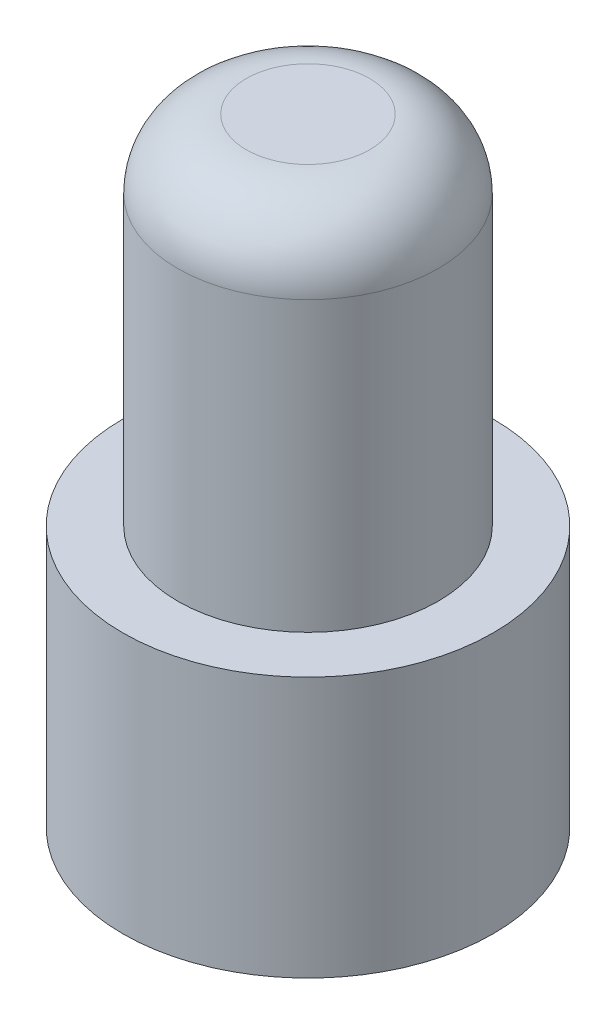
ISO-10303-21;
HEADER;
FILE_DESCRIPTION(('STEP AP214'),'2;1');
FILE_NAME('part.step','',(''),(''),'','','');
FILE_SCHEMA(('AUTOMOTIVE_DESIGN { 1 0 10303 214 1 1 1 1 }'));
ENDSEC;
DATA;
#1=APPLICATION_CONTEXT('core data for automotive mechanical design processes');
#2=APPLICATION_PROTOCOL_DEFINITION('international standard','automotive_design',2000,#1);
#3=PRODUCT_CONTEXT('',#1,'mechanical');
#4=PRODUCT('Part','Part','',(#3));
#5=PRODUCT_RELATED_PRODUCT_CATEGORY('part','',(#4));
#6=PRODUCT_DEFINITION_FORMATION('','',#4);
#7=PRODUCT_DEFINITION_CONTEXT('part definition',#1,'design');
#8=PRODUCT_DEFINITION('design','',#6,#7);
#9=PRODUCT_DEFINITION_SHAPE('','',#8);
#10=(LENGTH_UNIT() NAMED_UNIT(*) SI_UNIT(.MILLI.,.METRE.));
#11=(NAMED_UNIT(*) PLANE_ANGLE_UNIT() SI_UNIT($,.RADIAN.));
#12=(NAMED_UNIT(*) SI_UNIT($,.STERADIAN.) SOLID_ANGLE_UNIT());
#13=UNCERTAINTY_MEASURE_WITH_UNIT(LENGTH_MEASURE(1.E-05),#10,'distance_accuracy_value','');
#14=(GEOMETRIC_REPRESENTATION_CONTEXT(3) GLOBAL_UNCERTAINTY_ASSIGNED_CONTEXT((#13)) GLOBAL_UNIT_ASSIGNED_CONTEXT((#10,
#11,#12)) REPRESENTATION_CONTEXT('',''));
#15=CARTESIAN_POINT('',(0.,0.,0.));
#16=DIRECTION('',(0.,0.,1.));
#17=DIRECTION('',(1.,0.,0.));
#18=AXIS2_PLACEMENT_3D('',#15,#16,#17);
#19=CARTESIAN_POINT('',(-13.6190875592031,0.,0.));
#20=DIRECTION('',(0.,1.,0.));
#21=DIRECTION('',(0.,0.,1.));
#22=AXIS2_PLACEMENT_3D('',#19,#20,#21);
#23=PLANE('',#22);
#24=CARTESIAN_POINT('',(-6.86908755920311,0.,0.));
#25=DIRECTION('',(0.,-1.,0.));
#26=DIRECTION('',(0.,0.,-1.));
#27=AXIS2_PLACEMENT_3D('',#24,#25,#26);
#28=CIRCLE('',#27,6.75);
#29=CARTESIAN_POINT('',(-6.86908755920311,0.,-6.75));
#30=VERTEX_POINT('',#29);
#31=EDGE_CURVE('E51',#30,#30,#28,.T.);
#32=ORIENTED_EDGE('',*,*,#31,.T.);
#33=EDGE_LOOP('',(#32));
#34=FACE_BOUND('',#33,.T.);
#35=ADVANCED_FACE('F31',(#34),#23,.F.);
#36=CARTESIAN_POINT('',(-11.6190875592031,22.5,0.));
#37=DIRECTION('',(0.,-1.,0.));
#38=DIRECTION('',(0.,0.,-1.));
#39=AXIS2_PLACEMENT_3D('',#36,#37,#38);
#40=PLANE('',#39);
#41=CARTESIAN_POINT('',(-6.86908755920311,22.5,0.));
#42=DIRECTION('',(0.,-1.,0.));
#43=DIRECTION('',(0.,0.,-1.));
#44=AXIS2_PLACEMENT_3D('',#41,#42,#43);
#45=CIRCLE('',#44,2.25);
#46=CARTESIAN_POINT('',(-6.86908755920311,22.5,-2.25));
#47=VERTEX_POINT('',#46);
#48=EDGE_CURVE('E10',#47,#47,#45,.F.);
#49=ORIENTED_EDGE('',*,*,#48,.T.);
#50=EDGE_LOOP('',(#49));
#51=FACE_BOUND('',#50,.T.);
#52=ADVANCED_FACE('F70',(#51),#40,.F.);
#53=CARTESIAN_POINT('',(-6.86908755920311,0.,0.));
#54=DIRECTION('',(0.,-1.,0.));
#55=DIRECTION('',(0.,0.,-1.));
#56=AXIS2_PLACEMENT_3D('',#53,#54,#55);
#57=CYLINDRICAL_SURFACE('',#56,4.75);
#58=CARTESIAN_POINT('',(-6.86908755920311,20.,0.));
#59=DIRECTION('',(0.,-1.,0.));
#60=DIRECTION('',(0.,0.,-1.));
#61=AXIS2_PLACEMENT_3D('',#58,#59,#60);
#62=CIRCLE('',#61,4.75);
#63=CARTESIAN_POINT('',(-6.86908755920311,20.,-4.75));
#64=VERTEX_POINT('',#63);
#65=EDGE_CURVE('E38',#64,#64,#62,.T.);
#66=ORIENTED_EDGE('',*,*,#65,.T.);
#67=EDGE_LOOP('',(#66));
#68=FACE_BOUND('',#67,.T.);
#69=CARTESIAN_POINT('',(-6.86908755920311,9.5,0.));
#70=DIRECTION('',(0.,-1.,0.));
#71=DIRECTION('',(0.,0.,-1.));
#72=AXIS2_PLACEMENT_3D('',#69,#70,#71);
#73=CIRCLE('',#72,4.75);
#74=CARTESIAN_POINT('',(-6.86908755920311,9.5,-4.75));
#75=VERTEX_POINT('',#74);
#76=EDGE_CURVE('E42',#75,#75,#73,.T.);
#77=ORIENTED_EDGE('',*,*,#76,.F.);
#78=EDGE_LOOP('',(#77));
#79=FACE_BOUND('',#78,.T.);
#80=ADVANCED_FACE('F65',(#68,#79),#57,.T.);
#81=CARTESIAN_POINT('',(-13.6190875592031,9.5,0.));
#82=DIRECTION('',(0.,-1.,0.));
#83=DIRECTION('',(0.,0.,-1.));
#84=AXIS2_PLACEMENT_3D('',#81,#82,#83);
#85=PLANE('',#84);
#86=CARTESIAN_POINT('',(-6.86908755920311,9.5,0.));
#87=DIRECTION('',(0.,-1.,0.));
#88=DIRECTION('',(0.,0.,-1.));
#89=AXIS2_PLACEMENT_3D('',#86,#87,#88);
#90=CIRCLE('',#89,6.75);
#91=CARTESIAN_POINT('',(-6.86908755920311,9.5,-6.75));
#92=VERTEX_POINT('',#91);
#93=EDGE_CURVE('E46',#92,#92,#90,.T.);
#94=ORIENTED_EDGE('',*,*,#93,.F.);
#95=EDGE_LOOP('',(#94));
#96=FACE_BOUND('',#95,.T.);
#97=ORIENTED_EDGE('',*,*,#76,.T.);
#98=EDGE_LOOP('',(#97));
#99=FACE_BOUND('',#98,.T.);
#100=ADVANCED_FACE('F59',(#96,#99),#85,.F.);
#101=CARTESIAN_POINT('',(-6.86908755920311,0.,0.));
#102=DIRECTION('',(0.,-1.,0.));
#103=DIRECTION('',(0.,0.,-1.));
#104=AXIS2_PLACEMENT_3D('',#101,#102,#103);
#105=CYLINDRICAL_SURFACE('',#104,6.75);
#106=ORIENTED_EDGE('',*,*,#31,.F.);
#107=EDGE_LOOP('',(#106));
#108=FACE_BOUND('',#107,.T.);
#109=ORIENTED_EDGE('',*,*,#93,.T.);
#110=EDGE_LOOP('',(#109));
#111=FACE_BOUND('',#110,.T.);
#112=ADVANCED_FACE('F56',(#108,#111),#105,.T.);
#113=CARTESIAN_POINT('',(-6.86908755920311,20.,0.));
#114=DIRECTION('',(0.,-1.,0.));
#115=DIRECTION('',(0.,0.,-1.));
#116=AXIS2_PLACEMENT_3D('',#113,#114,#115);
#117=DEGENERATE_TOROIDAL_SURFACE('',#116,2.25,2.5,.T.);
#118=ORIENTED_EDGE('',*,*,#48,.F.);
#119=EDGE_LOOP('',(#118));
#120=FACE_BOUND('',#119,.T.);
#121=ORIENTED_EDGE('',*,*,#65,.F.);
#122=EDGE_LOOP('',(#121));
#123=FACE_BOUND('',#122,.T.);
#124=ADVANCED_FACE('F33',(#120,#123),#117,.T.);
#125=CLOSED_SHELL('',(#35,#52,#80,#100,#112,#124));
#126=MANIFOLD_SOLID_BREP('B2',#125);
#127=ADVANCED_BREP_SHAPE_REPRESENTATION('',(#18,#126),#14);
#128=SHAPE_DEFINITION_REPRESENTATION(#9,#127);
ENDSEC;
END-ISO-10303-21;
